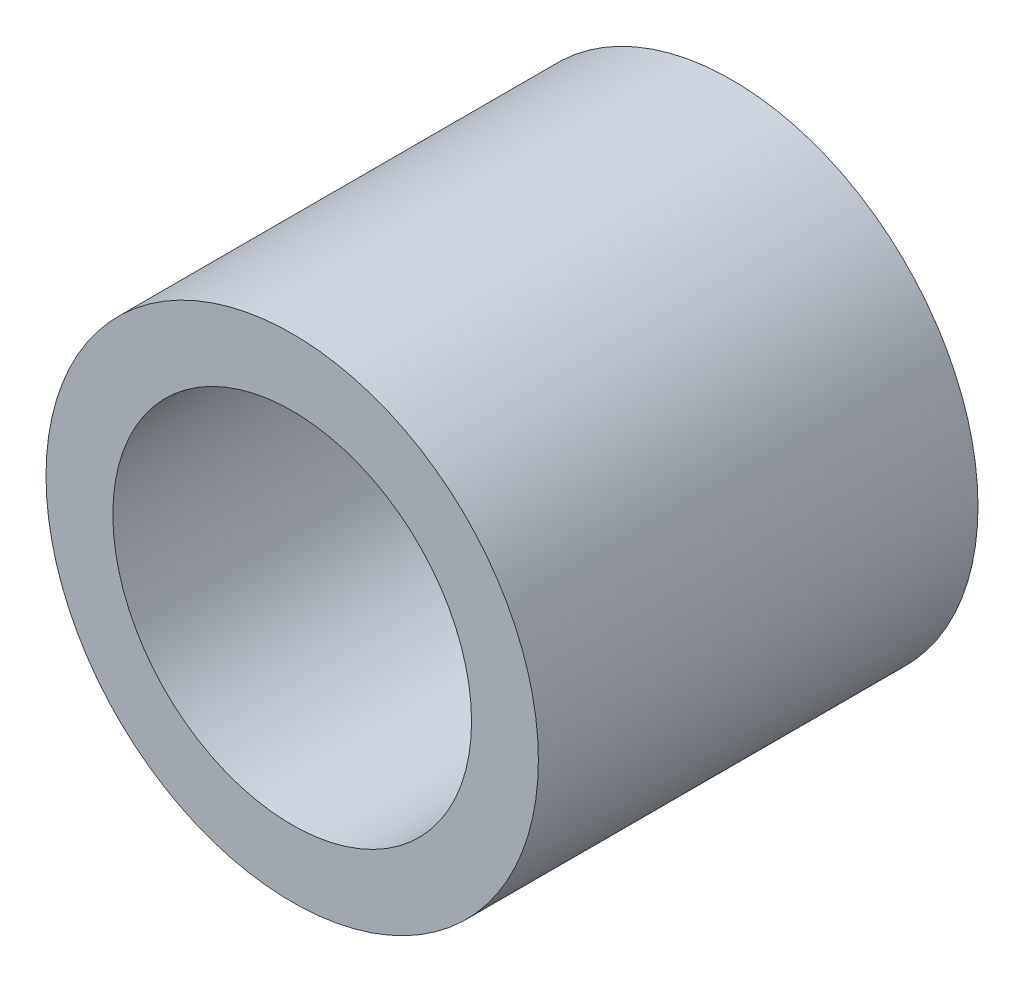
ISO-10303-21;
HEADER;
FILE_DESCRIPTION(('STEP AP214'),'2;1');
FILE_NAME('part.step','',(''),(''),'','','');
FILE_SCHEMA(('AUTOMOTIVE_DESIGN { 1 0 10303 214 1 1 1 1 }'));
ENDSEC;
DATA;
#1=APPLICATION_CONTEXT('core data for automotive mechanical design processes');
#2=APPLICATION_PROTOCOL_DEFINITION('international standard','automotive_design',2000,#1);
#3=PRODUCT_CONTEXT('',#1,'mechanical');
#4=PRODUCT('Part','Part','',(#3));
#5=PRODUCT_RELATED_PRODUCT_CATEGORY('part','',(#4));
#6=PRODUCT_DEFINITION_FORMATION('','',#4);
#7=PRODUCT_DEFINITION_CONTEXT('part definition',#1,'design');
#8=PRODUCT_DEFINITION('design','',#6,#7);
#9=PRODUCT_DEFINITION_SHAPE('','',#8);
#10=(LENGTH_UNIT() NAMED_UNIT(*) SI_UNIT(.MILLI.,.METRE.));
#11=(NAMED_UNIT(*) PLANE_ANGLE_UNIT() SI_UNIT($,.RADIAN.));
#12=(NAMED_UNIT(*) SI_UNIT($,.STERADIAN.) SOLID_ANGLE_UNIT());
#13=UNCERTAINTY_MEASURE_WITH_UNIT(LENGTH_MEASURE(1.E-05),#10,'distance_accuracy_value','');
#14=(GEOMETRIC_REPRESENTATION_CONTEXT(3) GLOBAL_UNCERTAINTY_ASSIGNED_CONTEXT((#13)) GLOBAL_UNIT_ASSIGNED_CONTEXT((#10,
#11,#12)) REPRESENTATION_CONTEXT('',''));
#15=CARTESIAN_POINT('',(0.,0.,0.));
#16=DIRECTION('',(0.,0.,1.));
#17=DIRECTION('',(1.,0.,0.));
#18=AXIS2_PLACEMENT_3D('',#15,#16,#17);
#19=CARTESIAN_POINT('',(0.,0.,25.));
#20=DIRECTION('',(0.,0.,1.));
#21=DIRECTION('',(1.,0.,0.));
#22=AXIS2_PLACEMENT_3D('',#19,#20,#21);
#23=PLANE('',#22);
#24=CARTESIAN_POINT('',(0.,0.,25.));
#25=DIRECTION('',(0.,0.,1.));
#26=DIRECTION('',(1.,0.,0.));
#27=AXIS2_PLACEMENT_3D('',#24,#25,#26);
#28=CIRCLE('',#27,14.);
#29=CARTESIAN_POINT('',(14.,0.,25.));
#30=VERTEX_POINT('',#29);
#31=EDGE_CURVE('E10',#30,#30,#28,.T.);
#32=ORIENTED_EDGE('',*,*,#31,.T.);
#33=EDGE_LOOP('',(#32));
#34=FACE_BOUND('',#33,.T.);
#35=CARTESIAN_POINT('',(0.,0.,25.));
#36=DIRECTION('',(0.,0.,1.));
#37=DIRECTION('',(1.,0.,0.));
#38=AXIS2_PLACEMENT_3D('',#35,#36,#37);
#39=CIRCLE('',#38,10.2);
#40=CARTESIAN_POINT('',(10.2,0.,25.));
#41=VERTEX_POINT('',#40);
#42=EDGE_CURVE('E45',#41,#41,#39,.T.);
#43=ORIENTED_EDGE('',*,*,#42,.F.);
#44=EDGE_LOOP('',(#43));
#45=FACE_BOUND('',#44,.T.);
#46=ADVANCED_FACE('F34',(#34,#45),#23,.T.);
#47=CARTESIAN_POINT('',(0.,0.,0.));
#48=DIRECTION('',(0.,0.,1.));
#49=DIRECTION('',(1.,0.,0.));
#50=AXIS2_PLACEMENT_3D('',#47,#48,#49);
#51=PLANE('',#50);
#52=CARTESIAN_POINT('',(0.,0.,0.));
#53=DIRECTION('',(0.,0.,1.));
#54=DIRECTION('',(1.,0.,0.));
#55=AXIS2_PLACEMENT_3D('',#52,#53,#54);
#56=CIRCLE('',#55,14.);
#57=CARTESIAN_POINT('',(14.,0.,0.));
#58=VERTEX_POINT('',#57);
#59=EDGE_CURVE('E38',#58,#58,#56,.T.);
#60=ORIENTED_EDGE('',*,*,#59,.F.);
#61=EDGE_LOOP('',(#60));
#62=FACE_BOUND('',#61,.T.);
#63=CARTESIAN_POINT('',(0.,0.,0.));
#64=DIRECTION('',(0.,0.,1.));
#65=DIRECTION('',(1.,0.,0.));
#66=AXIS2_PLACEMENT_3D('',#63,#64,#65);
#67=CIRCLE('',#66,10.2);
#68=CARTESIAN_POINT('',(10.2,0.,0.));
#69=VERTEX_POINT('',#68);
#70=EDGE_CURVE('E47',#69,#69,#67,.T.);
#71=ORIENTED_EDGE('',*,*,#70,.T.);
#72=EDGE_LOOP('',(#71));
#73=FACE_BOUND('',#72,.T.);
#74=ADVANCED_FACE('F57',(#62,#73),#51,.F.);
#75=CARTESIAN_POINT('',(0.,0.,25.));
#76=DIRECTION('',(0.,0.,-1.));
#77=DIRECTION('',(-1.,0.,0.));
#78=AXIS2_PLACEMENT_3D('',#75,#76,#77);
#79=CYLINDRICAL_SURFACE('',#78,14.);
#80=ORIENTED_EDGE('',*,*,#31,.F.);
#81=EDGE_LOOP('',(#80));
#82=FACE_BOUND('',#81,.T.);
#83=ORIENTED_EDGE('',*,*,#59,.T.);
#84=EDGE_LOOP('',(#83));
#85=FACE_BOUND('',#84,.T.);
#86=ADVANCED_FACE('F36',(#82,#85),#79,.T.);
#87=CARTESIAN_POINT('',(0.,0.,25.));
#88=DIRECTION('',(0.,0.,-1.));
#89=DIRECTION('',(-1.,0.,0.));
#90=AXIS2_PLACEMENT_3D('',#87,#88,#89);
#91=CYLINDRICAL_SURFACE('',#90,10.2);
#92=ORIENTED_EDGE('',*,*,#42,.T.);
#93=EDGE_LOOP('',(#92));
#94=FACE_BOUND('',#93,.T.);
#95=ORIENTED_EDGE('',*,*,#70,.F.);
#96=EDGE_LOOP('',(#95));
#97=FACE_BOUND('',#96,.T.);
#98=ADVANCED_FACE('F53',(#94,#97),#91,.F.);
#99=CLOSED_SHELL('',(#46,#74,#86,#98));
#100=MANIFOLD_SOLID_BREP('B2',#99);
#101=ADVANCED_BREP_SHAPE_REPRESENTATION('',(#18,#100),#14);
#102=SHAPE_DEFINITION_REPRESENTATION(#9,#101);
ENDSEC;
END-ISO-10303-21;
